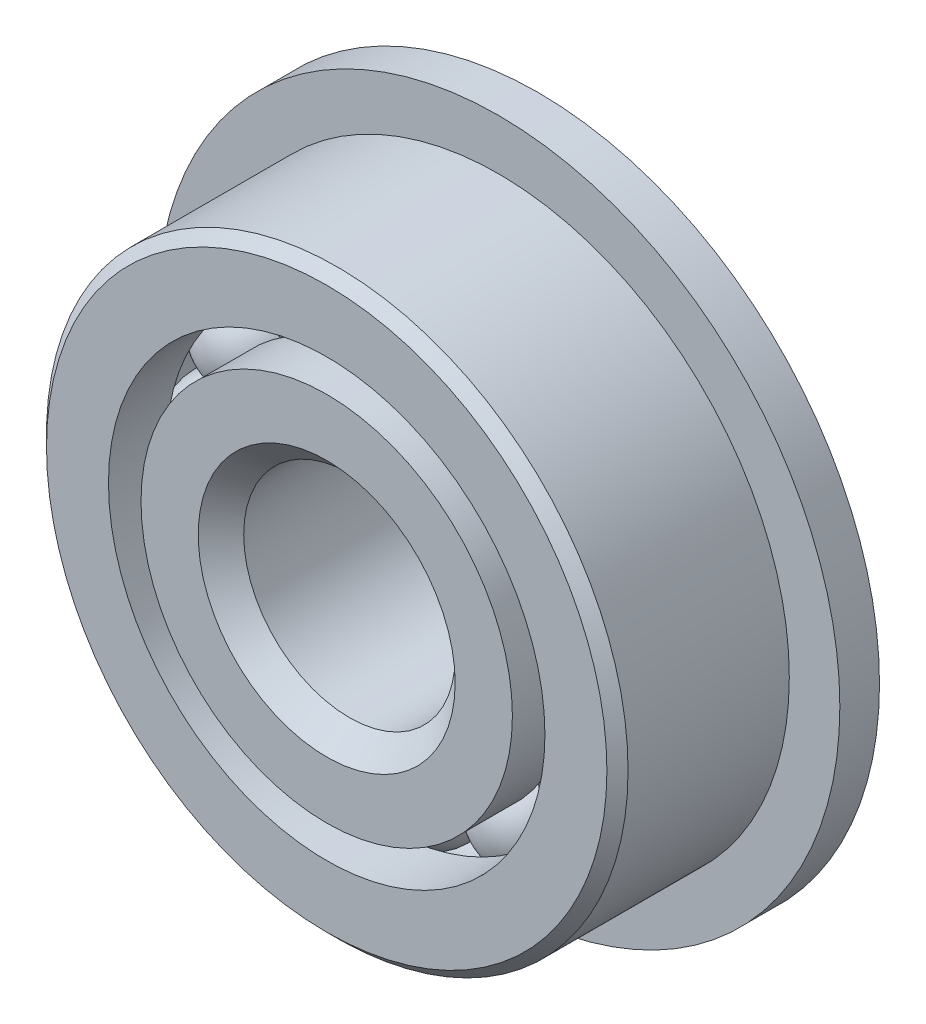
ISO-10303-21;
HEADER;
FILE_DESCRIPTION(('STEP AP214'),'2;1');
FILE_NAME('part.step','',(''),(''),'','','');
FILE_SCHEMA(('AUTOMOTIVE_DESIGN { 1 0 10303 214 1 1 1 1 }'));
ENDSEC;
DATA;
#1=APPLICATION_CONTEXT('core data for automotive mechanical design processes');
#2=APPLICATION_PROTOCOL_DEFINITION('international standard','automotive_design',2000,#1);
#3=PRODUCT_CONTEXT('',#1,'mechanical');
#4=PRODUCT('Part','Part','',(#3));
#5=PRODUCT_RELATED_PRODUCT_CATEGORY('part','',(#4));
#6=PRODUCT_DEFINITION_FORMATION('','',#4);
#7=PRODUCT_DEFINITION_CONTEXT('part definition',#1,'design');
#8=PRODUCT_DEFINITION('design','',#6,#7);
#9=PRODUCT_DEFINITION_SHAPE('','',#8);
#10=(LENGTH_UNIT() NAMED_UNIT(*) SI_UNIT(.MILLI.,.METRE.));
#11=(NAMED_UNIT(*) PLANE_ANGLE_UNIT() SI_UNIT($,.RADIAN.));
#12=(NAMED_UNIT(*) SI_UNIT($,.STERADIAN.) SOLID_ANGLE_UNIT());
#13=UNCERTAINTY_MEASURE_WITH_UNIT(LENGTH_MEASURE(1.E-05),#10,'distance_accuracy_value','');
#14=(GEOMETRIC_REPRESENTATION_CONTEXT(3) GLOBAL_UNCERTAINTY_ASSIGNED_CONTEXT((#13)) GLOBAL_UNIT_ASSIGNED_CONTEXT((#10,
#11,#12)) REPRESENTATION_CONTEXT('',''));
#15=CARTESIAN_POINT('',(0.,0.,0.));
#16=DIRECTION('',(0.,0.,1.));
#17=DIRECTION('',(1.,0.,0.));
#18=AXIS2_PLACEMENT_3D('',#15,#16,#17);
#19=CARTESIAN_POINT('',(-3.03212499999993,5.25179455489982,0.));
#20=DIRECTION('',(0.,0.,1.));
#21=DIRECTION('',(-0.499999999999989,0.866025403784445,0.));
#22=AXIS2_PLACEMENT_3D('',#19,#20,#21);
#23=SPHERICAL_SURFACE('',#22,1.524);
#24=CARTESIAN_POINT('',(-3.03212499999993,5.25179455489982,1.524));
#25=VERTEX_POINT('',#24);
#26=VERTEX_LOOP('',#25);
#27=FACE_BOUND('',#26,.T.);
#28=ADVANCED_FACE('F39',(#27),#23,.T.);
#29=CLOSED_SHELL('',(#28));
#30=MANIFOLD_SOLID_BREP('B2',#29);
#31=CARTESIAN_POINT('',(-5.25179455489975,3.03212500000006,0.));
#32=DIRECTION('',(0.,0.,1.));
#33=DIRECTION('',(-0.866025403784433,0.50000000000001,0.));
#34=AXIS2_PLACEMENT_3D('',#31,#32,#33);
#35=SPHERICAL_SURFACE('',#34,1.524);
#36=CARTESIAN_POINT('',(-5.25179455489975,3.03212500000006,1.524));
#37=VERTEX_POINT('',#36);
#38=VERTEX_LOOP('',#37);
#39=FACE_BOUND('',#38,.T.);
#40=ADVANCED_FACE('F60',(#39),#35,.T.);
#41=CLOSED_SHELL('',(#40));
#42=MANIFOLD_SOLID_BREP('B6',#41);
#43=CARTESIAN_POINT('',(-6.06425,0.,0.));
#44=DIRECTION('',(0.,0.,1.));
#45=DIRECTION('',(-1.,0.,0.));
#46=AXIS2_PLACEMENT_3D('',#43,#44,#45);
#47=SPHERICAL_SURFACE('',#46,1.524);
#48=CARTESIAN_POINT('',(-6.06425,0.,1.524));
#49=VERTEX_POINT('',#48);
#50=VERTEX_LOOP('',#49);
#51=FACE_BOUND('',#50,.T.);
#52=ADVANCED_FACE('F81',(#51),#47,.T.);
#53=CLOSED_SHELL('',(#52));
#54=MANIFOLD_SOLID_BREP('B35',#53);
#55=CARTESIAN_POINT('',(-5.25179455489981,-3.03212499999995,0.));
#56=DIRECTION('',(0.,0.,1.));
#57=DIRECTION('',(-0.866025403784443,-0.499999999999992,0.));
#58=AXIS2_PLACEMENT_3D('',#55,#56,#57);
#59=SPHERICAL_SURFACE('',#58,1.524);
#60=CARTESIAN_POINT('',(-5.25179455489981,-3.03212499999995,1.524));
#61=VERTEX_POINT('',#60);
#62=VERTEX_LOOP('',#61);
#63=FACE_BOUND('',#62,.T.);
#64=ADVANCED_FACE('F102',(#63),#59,.T.);
#65=CLOSED_SHELL('',(#64));
#66=MANIFOLD_SOLID_BREP('B56',#65);
#67=CARTESIAN_POINT('',(-3.03212500000004,-5.25179455489976,0.));
#68=DIRECTION('',(0.,0.,1.));
#69=DIRECTION('',(-0.500000000000007,-0.866025403784435,0.));
#70=AXIS2_PLACEMENT_3D('',#67,#68,#69);
#71=SPHERICAL_SURFACE('',#70,1.524);
#72=CARTESIAN_POINT('',(-3.03212500000004,-5.25179455489976,1.524));
#73=VERTEX_POINT('',#72);
#74=VERTEX_LOOP('',#73);
#75=FACE_BOUND('',#74,.T.);
#76=ADVANCED_FACE('F123',(#75),#71,.T.);
#77=CLOSED_SHELL('',(#76));
#78=MANIFOLD_SOLID_BREP('B77',#77);
#79=CARTESIAN_POINT('',(0.,-6.06425,0.));
#80=DIRECTION('',(0.,0.,1.));
#81=DIRECTION('',(0.,-1.,0.));
#82=AXIS2_PLACEMENT_3D('',#79,#80,#81);
#83=SPHERICAL_SURFACE('',#82,1.524);
#84=CARTESIAN_POINT('',(0.,-6.06425,1.524));
#85=VERTEX_POINT('',#84);
#86=VERTEX_LOOP('',#85);
#87=FACE_BOUND('',#86,.T.);
#88=ADVANCED_FACE('F144',(#87),#83,.T.);
#89=CLOSED_SHELL('',(#88));
#90=MANIFOLD_SOLID_BREP('B98',#89);
#91=CARTESIAN_POINT('',(3.03212499999997,-5.2517945548998,0.));
#92=DIRECTION('',(0.,0.,1.));
#93=DIRECTION('',(0.499999999999995,-0.866025403784442,0.));
#94=AXIS2_PLACEMENT_3D('',#91,#92,#93);
#95=SPHERICAL_SURFACE('',#94,1.524);
#96=CARTESIAN_POINT('',(3.03212499999997,-5.2517945548998,1.524));
#97=VERTEX_POINT('',#96);
#98=VERTEX_LOOP('',#97);
#99=FACE_BOUND('',#98,.T.);
#100=ADVANCED_FACE('F165',(#99),#95,.T.);
#101=CLOSED_SHELL('',(#100));
#102=MANIFOLD_SOLID_BREP('B119',#101);
#103=CARTESIAN_POINT('',(5.25179455489977,-3.03212500000002,0.));
#104=DIRECTION('',(0.,0.,1.));
#105=DIRECTION('',(0.866025403784436,-0.500000000000004,0.));
#106=AXIS2_PLACEMENT_3D('',#103,#104,#105);
#107=SPHERICAL_SURFACE('',#106,1.524);
#108=CARTESIAN_POINT('',(5.25179455489977,-3.03212500000002,1.524));
#109=VERTEX_POINT('',#108);
#110=VERTEX_LOOP('',#109);
#111=FACE_BOUND('',#110,.T.);
#112=ADVANCED_FACE('F186',(#111),#107,.T.);
#113=CLOSED_SHELL('',(#112));
#114=MANIFOLD_SOLID_BREP('B140',#113);
#115=CARTESIAN_POINT('',(6.06425,0.,0.));
#116=DIRECTION('',(0.,0.,1.));
#117=DIRECTION('',(1.,0.,0.));
#118=AXIS2_PLACEMENT_3D('',#115,#116,#117);
#119=SPHERICAL_SURFACE('',#118,1.524);
#120=CARTESIAN_POINT('',(6.06425,0.,1.524));
#121=VERTEX_POINT('',#120);
#122=VERTEX_LOOP('',#121);
#123=FACE_BOUND('',#122,.T.);
#124=ADVANCED_FACE('F207',(#123),#119,.T.);
#125=CLOSED_SHELL('',(#124));
#126=MANIFOLD_SOLID_BREP('B161',#125);
#127=CARTESIAN_POINT('',(5.25179455489979,3.03212499999999,0.));
#128=DIRECTION('',(0.,0.,1.));
#129=DIRECTION('',(0.86602540378444,0.499999999999998,0.));
#130=AXIS2_PLACEMENT_3D('',#127,#128,#129);
#131=SPHERICAL_SURFACE('',#130,1.524);
#132=CARTESIAN_POINT('',(5.25179455489979,3.03212499999999,1.524));
#133=VERTEX_POINT('',#132);
#134=VERTEX_LOOP('',#133);
#135=FACE_BOUND('',#134,.T.);
#136=ADVANCED_FACE('F228',(#135),#131,.T.);
#137=CLOSED_SHELL('',(#136));
#138=MANIFOLD_SOLID_BREP('B182',#137);
#139=CARTESIAN_POINT('',(3.03212500000001,5.25179455489978,0.));
#140=DIRECTION('',(0.,0.,1.));
#141=DIRECTION('',(0.500000000000001,0.866025403784438,0.));
#142=AXIS2_PLACEMENT_3D('',#139,#140,#141);
#143=SPHERICAL_SURFACE('',#142,1.524);
#144=CARTESIAN_POINT('',(3.03212500000001,5.25179455489978,1.524));
#145=VERTEX_POINT('',#144);
#146=VERTEX_LOOP('',#145);
#147=FACE_BOUND('',#146,.T.);
#148=ADVANCED_FACE('F249',(#147),#143,.T.);
#149=CLOSED_SHELL('',(#148));
#150=MANIFOLD_SOLID_BREP('B203',#149);
#151=CARTESIAN_POINT('',(0.,6.06425,0.));
#152=DIRECTION('',(0.,0.,1.));
#153=DIRECTION('',(0.,1.,0.));
#154=AXIS2_PLACEMENT_3D('',#151,#152,#153);
#155=SPHERICAL_SURFACE('',#154,1.524);
#156=CARTESIAN_POINT('',(0.,6.06425,1.524));
#157=VERTEX_POINT('',#156);
#158=VERTEX_LOOP('',#157);
#159=FACE_BOUND('',#158,.T.);
#160=ADVANCED_FACE('F271',(#159),#155,.T.);
#161=CLOSED_SHELL('',(#160));
#162=MANIFOLD_SOLID_BREP('B224',#161);
#163=CARTESIAN_POINT('',(0.,0.,3.175));
#164=DIRECTION('',(0.,0.,1.));
#165=DIRECTION('',(1.,0.,0.));
#166=AXIS2_PLACEMENT_3D('',#163,#164,#165);
#167=CYLINDRICAL_SURFACE('',#166,5.57578846153846);
#168=CARTESIAN_POINT('',(0.,0.,-1.44360012657376));
#169=DIRECTION('',(0.,0.,1.));
#170=DIRECTION('',(1.,0.,0.));
#171=AXIS2_PLACEMENT_3D('',#168,#169,#170);
#172=CIRCLE('',#171,5.57578846153846);
#173=CARTESIAN_POINT('',(5.57578846153846,0.,-1.44360012657376));
#174=VERTEX_POINT('',#173);
#175=EDGE_CURVE('E302',#174,#174,#172,.T.);
#176=ORIENTED_EDGE('',*,*,#175,.F.);
#177=EDGE_LOOP('',(#176));
#178=FACE_BOUND('',#177,.T.);
#179=CARTESIAN_POINT('',(0.,0.,-4.7625));
#180=DIRECTION('',(0.,0.,1.));
#181=DIRECTION('',(1.,0.,0.));
#182=AXIS2_PLACEMENT_3D('',#179,#180,#181);
#183=CIRCLE('',#182,5.57578846153846);
#184=CARTESIAN_POINT('',(5.57578846153846,0.,-4.7625));
#185=VERTEX_POINT('',#184);
#186=EDGE_CURVE('E306',#185,#185,#183,.T.);
#187=ORIENTED_EDGE('',*,*,#186,.T.);
#188=EDGE_LOOP('',(#187));
#189=FACE_BOUND('',#188,.T.);
#190=ADVANCED_FACE('F291',(#178,#189),#167,.T.);
#191=CARTESIAN_POINT('',(0.,3.4925,-4.7625));
#192=DIRECTION('',(0.,0.,1.));
#193=DIRECTION('',(1.,0.,0.));
#194=AXIS2_PLACEMENT_3D('',#191,#192,#193);
#195=PLANE('',#194);
#196=ORIENTED_EDGE('',*,*,#186,.F.);
#197=EDGE_LOOP('',(#196));
#198=FACE_BOUND('',#197,.T.);
#199=CARTESIAN_POINT('',(0.,0.,-4.7625));
#200=DIRECTION('',(0.,0.,1.));
#201=DIRECTION('',(1.,0.,0.));
#202=AXIS2_PLACEMENT_3D('',#199,#200,#201);
#203=CIRCLE('',#202,3.4925);
#204=CARTESIAN_POINT('',(3.4925,0.,-4.7625));
#205=VERTEX_POINT('',#204);
#206=EDGE_CURVE('E311',#205,#205,#203,.T.);
#207=ORIENTED_EDGE('',*,*,#206,.T.);
#208=EDGE_LOOP('',(#207));
#209=FACE_BOUND('',#208,.T.);
#210=ADVANCED_FACE('F338',(#198,#209),#195,.F.);
#211=CARTESIAN_POINT('',(0.,0.,-4.445));
#212=DIRECTION('',(0.,0.,-1.));
#213=DIRECTION('',(-1.,0.,0.));
#214=AXIS2_PLACEMENT_3D('',#211,#212,#213);
#215=CONICAL_SURFACE('',#214,3.175,0.785398163397443);
#216=ORIENTED_EDGE('',*,*,#206,.F.);
#217=EDGE_LOOP('',(#216));
#218=FACE_BOUND('',#217,.T.);
#219=CARTESIAN_POINT('',(0.,0.,-4.445));
#220=DIRECTION('',(0.,0.,1.));
#221=DIRECTION('',(1.,0.,0.));
#222=AXIS2_PLACEMENT_3D('',#219,#220,#221);
#223=CIRCLE('',#222,3.175);
#224=CARTESIAN_POINT('',(3.175,0.,-4.445));
#225=VERTEX_POINT('',#224);
#226=EDGE_CURVE('E314',#225,#225,#223,.T.);
#227=ORIENTED_EDGE('',*,*,#226,.T.);
#228=EDGE_LOOP('',(#227));
#229=FACE_BOUND('',#228,.T.);
#230=ADVANCED_FACE('F344',(#218,#229),#215,.F.);
#231=CARTESIAN_POINT('',(0.,0.,3.175));
#232=DIRECTION('',(0.,0.,1.));
#233=DIRECTION('',(1.,0.,0.));
#234=AXIS2_PLACEMENT_3D('',#231,#232,#233);
#235=CYLINDRICAL_SURFACE('',#234,3.175);
#236=ORIENTED_EDGE('',*,*,#226,.F.);
#237=EDGE_LOOP('',(#236));
#238=FACE_BOUND('',#237,.T.);
#239=CARTESIAN_POINT('',(0.,0.,2.492375));
#240=DIRECTION('',(0.,0.,1.));
#241=DIRECTION('',(1.,0.,0.));
#242=AXIS2_PLACEMENT_3D('',#239,#240,#241);
#243=CIRCLE('',#242,3.175);
#244=CARTESIAN_POINT('',(3.175,0.,2.492375));
#245=VERTEX_POINT('',#244);
#246=EDGE_CURVE('E317',#245,#245,#243,.T.);
#247=ORIENTED_EDGE('',*,*,#246,.T.);
#248=EDGE_LOOP('',(#247));
#249=FACE_BOUND('',#248,.T.);
#250=ADVANCED_FACE('F334',(#238,#249),#235,.F.);
#251=CARTESIAN_POINT('',(0.,0.,3.175));
#252=DIRECTION('',(0.,0.,1.));
#253=DIRECTION('',(1.,0.,0.));
#254=AXIS2_PLACEMENT_3D('',#251,#252,#253);
#255=CONICAL_SURFACE('',#254,3.857625,0.78539816339745);
#256=ORIENTED_EDGE('',*,*,#246,.F.);
#257=EDGE_LOOP('',(#256));
#258=FACE_BOUND('',#257,.T.);
#259=CARTESIAN_POINT('',(0.,0.,3.175));
#260=DIRECTION('',(0.,0.,1.));
#261=DIRECTION('',(1.,0.,0.));
#262=AXIS2_PLACEMENT_3D('',#259,#260,#261);
#263=CIRCLE('',#262,3.857625);
#264=CARTESIAN_POINT('',(3.857625,0.,3.175));
#265=VERTEX_POINT('',#264);
#266=EDGE_CURVE('E320',#265,#265,#263,.T.);
#267=ORIENTED_EDGE('',*,*,#266,.T.);
#268=EDGE_LOOP('',(#267));
#269=FACE_BOUND('',#268,.T.);
#270=ADVANCED_FACE('F324',(#258,#269),#255,.F.);
#271=CARTESIAN_POINT('',(0.,5.57578846153846,3.175));
#272=DIRECTION('',(0.,0.,-1.));
#273=DIRECTION('',(-1.,0.,0.));
#274=AXIS2_PLACEMENT_3D('',#271,#272,#273);
#275=PLANE('',#274);
#276=CARTESIAN_POINT('',(0.,0.,3.175));
#277=DIRECTION('',(0.,0.,1.));
#278=DIRECTION('',(1.,0.,0.));
#279=AXIS2_PLACEMENT_3D('',#276,#277,#278);
#280=CIRCLE('',#279,5.57578846153846);
#281=CARTESIAN_POINT('',(5.57578846153846,0.,3.175));
#282=VERTEX_POINT('',#281);
#283=EDGE_CURVE('E298',#282,#282,#280,.T.);
#284=ORIENTED_EDGE('',*,*,#283,.T.);
#285=EDGE_LOOP('',(#284));
#286=FACE_BOUND('',#285,.T.);
#287=ORIENTED_EDGE('',*,*,#266,.F.);
#288=EDGE_LOOP('',(#287));
#289=FACE_BOUND('',#288,.T.);
#290=ADVANCED_FACE('F293',(#286,#289),#275,.F.);
#291=CARTESIAN_POINT('',(0.,0.,0.));
#292=DIRECTION('',(0.,0.,1.));
#293=DIRECTION('',(1.,0.,0.));
#294=AXIS2_PLACEMENT_3D('',#291,#292,#293);
#295=TOROIDAL_SURFACE('',#294,6.06425,1.524);
#296=CARTESIAN_POINT('',(0.,0.,1.44360012657376));
#297=DIRECTION('',(0.,0.,1.));
#298=DIRECTION('',(1.,0.,0.));
#299=AXIS2_PLACEMENT_3D('',#296,#297,#298);
#300=CIRCLE('',#299,5.57578846153846);
#301=CARTESIAN_POINT('',(5.57578846153846,0.,1.44360012657376));
#302=VERTEX_POINT('',#301);
#303=EDGE_CURVE('E270',#302,#302,#300,.T.);
#304=ORIENTED_EDGE('',*,*,#303,.F.);
#305=EDGE_LOOP('',(#304));
#306=FACE_BOUND('',#305,.T.);
#307=ORIENTED_EDGE('',*,*,#175,.T.);
#308=EDGE_LOOP('',(#307));
#309=FACE_BOUND('',#308,.T.);
#310=ADVANCED_FACE('F327',(#306,#309),#295,.F.);
#311=CARTESIAN_POINT('',(0.,0.,3.175));
#312=DIRECTION('',(0.,0.,1.));
#313=DIRECTION('',(1.,0.,0.));
#314=AXIS2_PLACEMENT_3D('',#311,#312,#313);
#315=CYLINDRICAL_SURFACE('',#314,5.57578846153846);
#316=ORIENTED_EDGE('',*,*,#283,.F.);
#317=EDGE_LOOP('',(#316));
#318=FACE_BOUND('',#317,.T.);
#319=ORIENTED_EDGE('',*,*,#303,.T.);
#320=EDGE_LOOP('',(#319));
#321=FACE_BOUND('',#320,.T.);
#322=ADVANCED_FACE('F332',(#318,#321),#315,.T.);
#323=CLOSED_SHELL('',(#190,#210,#230,#250,#270,#290,#310,#322));
#324=MANIFOLD_SOLID_BREP('B245',#323);
#325=CARTESIAN_POINT('',(0.,0.,2.8575));
#326=DIRECTION('',(0.,0.,-1.));
#327=DIRECTION('',(-1.,0.,0.));
#328=AXIS2_PLACEMENT_3D('',#325,#326,#327);
#329=CONICAL_SURFACE('',#328,8.73125,0.785398163397446);
#330=CARTESIAN_POINT('',(0.,0.,3.175));
#331=DIRECTION('',(0.,0.,1.));
#332=DIRECTION('',(1.,0.,0.));
#333=AXIS2_PLACEMENT_3D('',#330,#331,#332);
#334=CIRCLE('',#333,8.41375);
#335=CARTESIAN_POINT('',(8.41375,0.,3.175));
#336=VERTEX_POINT('',#335);
#337=EDGE_CURVE('E441',#336,#336,#334,.T.);
#338=ORIENTED_EDGE('',*,*,#337,.F.);
#339=EDGE_LOOP('',(#338));
#340=FACE_BOUND('',#339,.T.);
#341=CARTESIAN_POINT('',(0.,0.,2.8575));
#342=DIRECTION('',(0.,0.,1.));
#343=DIRECTION('',(1.,0.,0.));
#344=AXIS2_PLACEMENT_3D('',#341,#342,#343);
#345=CIRCLE('',#344,8.73125);
#346=CARTESIAN_POINT('',(8.73125,0.,2.8575));
#347=VERTEX_POINT('',#346);
#348=EDGE_CURVE('E290',#347,#347,#345,.T.);
#349=ORIENTED_EDGE('',*,*,#348,.T.);
#350=EDGE_LOOP('',(#349));
#351=FACE_BOUND('',#350,.T.);
#352=ADVANCED_FACE('F419',(#340,#351),#329,.T.);
#353=CARTESIAN_POINT('',(0.,0.,3.175));
#354=DIRECTION('',(0.,0.,1.));
#355=DIRECTION('',(1.,0.,0.));
#356=AXIS2_PLACEMENT_3D('',#353,#354,#355);
#357=CYLINDRICAL_SURFACE('',#356,8.73125);
#358=CARTESIAN_POINT('',(0.,0.,-1.984375));
#359=DIRECTION('',(0.,0.,1.));
#360=DIRECTION('',(1.,0.,0.));
#361=AXIS2_PLACEMENT_3D('',#358,#359,#360);
#362=CIRCLE('',#361,8.73125);
#363=CARTESIAN_POINT('',(8.73125,0.,-1.984375));
#364=VERTEX_POINT('',#363);
#365=EDGE_CURVE('E422',#364,#364,#362,.T.);
#366=ORIENTED_EDGE('',*,*,#365,.T.);
#367=EDGE_LOOP('',(#366));
#368=FACE_BOUND('',#367,.T.);
#369=ORIENTED_EDGE('',*,*,#348,.F.);
#370=EDGE_LOOP('',(#369));
#371=FACE_BOUND('',#370,.T.);
#372=ADVANCED_FACE('F462',(#368,#371),#357,.T.);
#373=CARTESIAN_POINT('',(0.,8.41375,-3.175));
#374=DIRECTION('',(0.,0.,1.));
#375=DIRECTION('',(1.,0.,0.));
#376=AXIS2_PLACEMENT_3D('',#373,#374,#375);
#377=PLANE('',#376);
#378=CARTESIAN_POINT('',(0.,0.,-3.175));
#379=DIRECTION('',(0.,0.,1.));
#380=DIRECTION('',(1.,0.,0.));
#381=AXIS2_PLACEMENT_3D('',#378,#379,#380);
#382=CIRCLE('',#381,6.55271153846154);
#383=CARTESIAN_POINT('',(6.55271153846154,0.,-3.175));
#384=VERTEX_POINT('',#383);
#385=EDGE_CURVE('E426',#384,#384,#382,.T.);
#386=ORIENTED_EDGE('',*,*,#385,.T.);
#387=EDGE_LOOP('',(#386));
#388=FACE_BOUND('',#387,.T.);
#389=CARTESIAN_POINT('',(0.,0.,-3.175));
#390=DIRECTION('',(0.,0.,-1.));
#391=DIRECTION('',(-1.,0.,0.));
#392=AXIS2_PLACEMENT_3D('',#389,#390,#391);
#393=CIRCLE('',#392,10.2489);
#394=CARTESIAN_POINT('',(-10.2489,0.,-3.175));
#395=VERTEX_POINT('',#394);
#396=EDGE_CURVE('E444',#395,#395,#393,.T.);
#397=ORIENTED_EDGE('',*,*,#396,.T.);
#398=EDGE_LOOP('',(#397));
#399=FACE_BOUND('',#398,.T.);
#400=ADVANCED_FACE('F465',(#388,#399),#377,.F.);
#401=CARTESIAN_POINT('',(0.,0.,3.175));
#402=DIRECTION('',(0.,0.,1.));
#403=DIRECTION('',(1.,0.,0.));
#404=AXIS2_PLACEMENT_3D('',#401,#402,#403);
#405=CYLINDRICAL_SURFACE('',#404,6.55271153846154);
#406=ORIENTED_EDGE('',*,*,#385,.F.);
#407=EDGE_LOOP('',(#406));
#408=FACE_BOUND('',#407,.T.);
#409=CARTESIAN_POINT('',(0.,0.,-1.44360012657376));
#410=DIRECTION('',(0.,0.,1.));
#411=DIRECTION('',(1.,0.,0.));
#412=AXIS2_PLACEMENT_3D('',#409,#410,#411);
#413=CIRCLE('',#412,6.55271153846154);
#414=CARTESIAN_POINT('',(6.55271153846154,0.,-1.44360012657376));
#415=VERTEX_POINT('',#414);
#416=EDGE_CURVE('E430',#415,#415,#413,.T.);
#417=ORIENTED_EDGE('',*,*,#416,.T.);
#418=EDGE_LOOP('',(#417));
#419=FACE_BOUND('',#418,.T.);
#420=ADVANCED_FACE('F470',(#408,#419),#405,.F.);
#421=CARTESIAN_POINT('',(0.,0.,0.));
#422=DIRECTION('',(0.,0.,1.));
#423=DIRECTION('',(1.,0.,0.));
#424=AXIS2_PLACEMENT_3D('',#421,#422,#423);
#425=TOROIDAL_SURFACE('',#424,6.06425,1.524);
#426=ORIENTED_EDGE('',*,*,#416,.F.);
#427=EDGE_LOOP('',(#426));
#428=FACE_BOUND('',#427,.T.);
#429=CARTESIAN_POINT('',(0.,0.,1.44360012657376));
#430=DIRECTION('',(0.,0.,1.));
#431=DIRECTION('',(1.,0.,0.));
#432=AXIS2_PLACEMENT_3D('',#429,#430,#431);
#433=CIRCLE('',#432,6.55271153846154);
#434=CARTESIAN_POINT('',(6.55271153846154,0.,1.44360012657376));
#435=VERTEX_POINT('',#434);
#436=EDGE_CURVE('E435',#435,#435,#433,.T.);
#437=ORIENTED_EDGE('',*,*,#436,.T.);
#438=EDGE_LOOP('',(#437));
#439=FACE_BOUND('',#438,.T.);
#440=ADVANCED_FACE('F477',(#428,#439),#425,.F.);
#441=CARTESIAN_POINT('',(0.,0.,3.175));
#442=DIRECTION('',(0.,0.,1.));
#443=DIRECTION('',(1.,0.,0.));
#444=AXIS2_PLACEMENT_3D('',#441,#442,#443);
#445=CYLINDRICAL_SURFACE('',#444,6.55271153846154);
#446=ORIENTED_EDGE('',*,*,#436,.F.);
#447=EDGE_LOOP('',(#446));
#448=FACE_BOUND('',#447,.T.);
#449=CARTESIAN_POINT('',(0.,0.,3.175));
#450=DIRECTION('',(0.,0.,1.));
#451=DIRECTION('',(1.,0.,0.));
#452=AXIS2_PLACEMENT_3D('',#449,#450,#451);
#453=CIRCLE('',#452,6.55271153846154);
#454=CARTESIAN_POINT('',(6.55271153846154,0.,3.175));
#455=VERTEX_POINT('',#454);
#456=EDGE_CURVE('E438',#455,#455,#453,.T.);
#457=ORIENTED_EDGE('',*,*,#456,.T.);
#458=EDGE_LOOP('',(#457));
#459=FACE_BOUND('',#458,.T.);
#460=ADVANCED_FACE('F481',(#448,#459),#445,.F.);
#461=CARTESIAN_POINT('',(0.,8.41375,3.175));
#462=DIRECTION('',(0.,0.,-1.));
#463=DIRECTION('',(-1.,0.,0.));
#464=AXIS2_PLACEMENT_3D('',#461,#462,#463);
#465=PLANE('',#464);
#466=ORIENTED_EDGE('',*,*,#456,.F.);
#467=EDGE_LOOP('',(#466));
#468=FACE_BOUND('',#467,.T.);
#469=ORIENTED_EDGE('',*,*,#337,.T.);
#470=EDGE_LOOP('',(#469));
#471=FACE_BOUND('',#470,.T.);
#472=ADVANCED_FACE('F457',(#468,#471),#465,.F.);
#473=CARTESIAN_POINT('',(0.,7.48323076923077,-1.984375));
#474=DIRECTION('',(0.,0.,1.));
#475=DIRECTION('',(1.,0.,0.));
#476=AXIS2_PLACEMENT_3D('',#473,#474,#475);
#477=PLANE('',#476);
#478=CARTESIAN_POINT('',(0.,0.,-1.984375));
#479=DIRECTION('',(0.,0.,-1.));
#480=DIRECTION('',(-1.,0.,0.));
#481=AXIS2_PLACEMENT_3D('',#478,#479,#480);
#482=CIRCLE('',#481,10.2489);
#483=CARTESIAN_POINT('',(-10.2489,0.,-1.984375));
#484=VERTEX_POINT('',#483);
#485=EDGE_CURVE('E447',#484,#484,#482,.T.);
#486=ORIENTED_EDGE('',*,*,#485,.F.);
#487=EDGE_LOOP('',(#486));
#488=FACE_BOUND('',#487,.T.);
#489=ORIENTED_EDGE('',*,*,#365,.F.);
#490=EDGE_LOOP('',(#489));
#491=FACE_BOUND('',#490,.T.);
#492=ADVANCED_FACE('F454',(#488,#491),#477,.T.);
#493=CARTESIAN_POINT('',(0.,0.,-4.7625));
#494=DIRECTION('',(0.,0.,-1.));
#495=DIRECTION('',(-1.,0.,0.));
#496=AXIS2_PLACEMENT_3D('',#493,#494,#495);
#497=CYLINDRICAL_SURFACE('',#496,10.2489);
#498=ORIENTED_EDGE('',*,*,#485,.T.);
#499=EDGE_LOOP('',(#498));
#500=FACE_BOUND('',#499,.T.);
#501=ORIENTED_EDGE('',*,*,#396,.F.);
#502=EDGE_LOOP('',(#501));
#503=FACE_BOUND('',#502,.T.);
#504=ADVANCED_FACE('F451',(#500,#503),#497,.T.);
#505=CLOSED_SHELL('',(#352,#372,#400,#420,#440,#460,#472,#492,#504));
#506=MANIFOLD_SOLID_BREP('B265',#505);
#507=ADVANCED_BREP_SHAPE_REPRESENTATION('',(#18,#30,#42,#54,#66,#78,#90,#102,#114,#126,#138,
#150,#162,#324,#506),#14);
#508=SHAPE_DEFINITION_REPRESENTATION(#9,#507);
ENDSEC;
END-ISO-10303-21;
